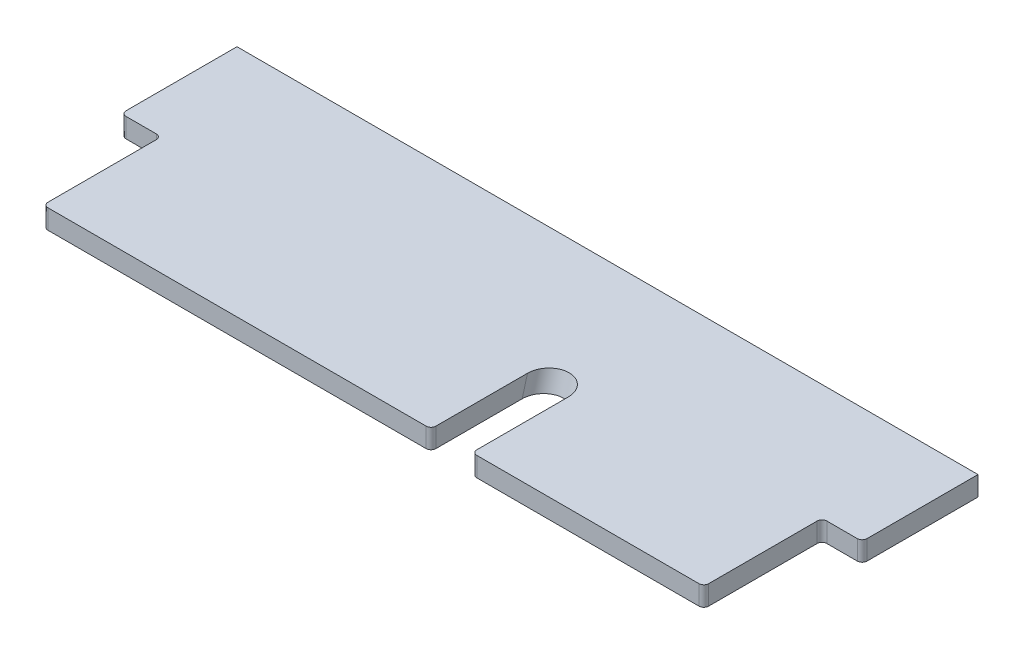
ISO-10303-21;
HEADER;
FILE_DESCRIPTION(('STEP AP214'),'2;1');
FILE_NAME('part.step','',(''),(''),'','','');
FILE_SCHEMA(('AUTOMOTIVE_DESIGN { 1 0 10303 214 1 1 1 1 }'));
ENDSEC;
DATA;
#1=APPLICATION_CONTEXT('core data for automotive mechanical design processes');
#2=APPLICATION_PROTOCOL_DEFINITION('international standard','automotive_design',2000,#1);
#3=PRODUCT_CONTEXT('',#1,'mechanical');
#4=PRODUCT('Part','Part','',(#3));
#5=PRODUCT_RELATED_PRODUCT_CATEGORY('part','',(#4));
#6=PRODUCT_DEFINITION_FORMATION('','',#4);
#7=PRODUCT_DEFINITION_CONTEXT('part definition',#1,'design');
#8=PRODUCT_DEFINITION('design','',#6,#7);
#9=PRODUCT_DEFINITION_SHAPE('','',#8);
#10=(LENGTH_UNIT() NAMED_UNIT(*) SI_UNIT(.MILLI.,.METRE.));
#11=(NAMED_UNIT(*) PLANE_ANGLE_UNIT() SI_UNIT($,.RADIAN.));
#12=(NAMED_UNIT(*) SI_UNIT($,.STERADIAN.) SOLID_ANGLE_UNIT());
#13=UNCERTAINTY_MEASURE_WITH_UNIT(LENGTH_MEASURE(1.E-05),#10,'distance_accuracy_value','');
#14=(GEOMETRIC_REPRESENTATION_CONTEXT(3) GLOBAL_UNCERTAINTY_ASSIGNED_CONTEXT((#13)) GLOBAL_UNIT_ASSIGNED_CONTEXT((#10,
#11,#12)) REPRESENTATION_CONTEXT('',''));
#15=CARTESIAN_POINT('',(0.,0.,0.));
#16=DIRECTION('',(0.,0.,1.));
#17=DIRECTION('',(1.,0.,0.));
#18=AXIS2_PLACEMENT_3D('',#15,#16,#17);
#19=CARTESIAN_POINT('',(-215.9,6.35,76.2));
#20=DIRECTION('',(0.,0.,-1.));
#21=DIRECTION('',(-1.,0.,0.));
#22=AXIS2_PLACEMENT_3D('',#19,#20,#21);
#23=PLANE('',#22);
#24=DIRECTION('',(1.,0.,0.));
#25=VECTOR('',#24,1.);
#26=CARTESIAN_POINT('',(-215.9,6.35,76.2));
#27=LINE('',#26,#25);
#28=CARTESIAN_POINT('',(-211.963,6.35,76.2));
#29=VERTEX_POINT('',#28);
#30=CARTESIAN_POINT('',(34.2899999999999,6.35,76.2));
#31=VERTEX_POINT('',#30);
#32=EDGE_CURVE('E230',#29,#31,#27,.T.);
#33=ORIENTED_EDGE('',*,*,#32,.F.);
#34=DIRECTION('',(0.,-1.,0.));
#35=VECTOR('',#34,1.);
#36=CARTESIAN_POINT('',(-211.963,6.35,76.2));
#37=LINE('',#36,#35);
#38=CARTESIAN_POINT('',(-211.963,-6.35,76.2));
#39=VERTEX_POINT('',#38);
#40=EDGE_CURVE('E352',#29,#39,#37,.T.);
#41=ORIENTED_EDGE('',*,*,#40,.T.);
#42=DIRECTION('',(1.,0.,0.));
#43=VECTOR('',#42,1.);
#44=CARTESIAN_POINT('',(-215.9,-6.35,76.2));
#45=LINE('',#44,#43);
#46=CARTESIAN_POINT('',(34.2899999999999,-6.35,76.2));
#47=VERTEX_POINT('',#46);
#48=EDGE_CURVE('E300',#39,#47,#45,.T.);
#49=ORIENTED_EDGE('',*,*,#48,.T.);
#50=DIRECTION('',(0.,-1.,0.));
#51=VECTOR('',#50,1.);
#52=CARTESIAN_POINT('',(34.2899999999999,6.35,76.2));
#53=LINE('',#52,#51);
#54=EDGE_CURVE('E64',#47,#31,#53,.F.);
#55=ORIENTED_EDGE('',*,*,#54,.T.);
#56=EDGE_LOOP('',(#33,#41,#49,#55));
#57=FACE_BOUND('',#56,.T.);
#58=ADVANCED_FACE('F48',(#57),#23,.F.);
#59=CARTESIAN_POINT('',(50.7999999999986,94.7896928963142,-10.6042856199856));
#60=DIRECTION('',(0.,-0.965182723476007,0.261576585923584));
#61=DIRECTION('',(0.,-0.261576585923584,-0.965182723476007));
#62=AXIS2_PLACEMENT_3D('',#59,#60,#61);
#63=CYLINDRICAL_SURFACE('',#62,13.3350000000001);
#64=CARTESIAN_POINT('',(50.7999999999986,6.34999999999999,13.363976933072));
#65=DIRECTION('',(0.,1.,0.));
#66=DIRECTION('',(0.,0.,1.));
#67=AXIS2_PLACEMENT_3D('',#64,#65,#66);
#68=ELLIPSE('',#67,13.8160367727838,13.3350000000001);
#69=CARTESIAN_POINT('',(37.4649999999999,6.34999999999999,13.363976933072));
#70=VERTEX_POINT('',#69);
#71=CARTESIAN_POINT('',(64.135,6.34999999999999,13.363976933072));
#72=VERTEX_POINT('',#71);
#73=EDGE_CURVE('E254',#70,#72,#68,.F.);
#74=ORIENTED_EDGE('',*,*,#73,.F.);
#75=DIRECTION('',(0.,-0.965182723476007,0.261576585923584));
#76=VECTOR('',#75,1.);
#77=CARTESIAN_POINT('',(37.4649999999985,94.7896928963142,-10.6042856199856));
#78=LINE('',#77,#76);
#79=CARTESIAN_POINT('',(37.4649999999999,-6.34999999999999,16.8058357235667));
#80=VERTEX_POINT('',#79);
#81=EDGE_CURVE('E277',#80,#70,#78,.F.);
#82=ORIENTED_EDGE('',*,*,#81,.F.);
#83=CARTESIAN_POINT('',(50.7999999999986,-6.34999999999999,16.8058357235667));
#84=DIRECTION('',(0.,1.,0.));
#85=DIRECTION('',(0.,0.,1.));
#86=AXIS2_PLACEMENT_3D('',#83,#84,#85);
#87=ELLIPSE('',#86,13.8160367727838,13.3350000000001);
#88=CARTESIAN_POINT('',(64.135,-6.34999999999999,16.8058357235667));
#89=VERTEX_POINT('',#88);
#90=EDGE_CURVE('E233',#80,#89,#87,.F.);
#91=ORIENTED_EDGE('',*,*,#90,.T.);
#92=DIRECTION('',(0.,-0.965182723476007,0.261576585923584));
#93=VECTOR('',#92,1.);
#94=CARTESIAN_POINT('',(64.1349999999987,94.7896928963142,-10.6042856199856));
#95=LINE('',#94,#93);
#96=EDGE_CURVE('E249',#89,#72,#95,.F.);
#97=ORIENTED_EDGE('',*,*,#96,.T.);
#98=EDGE_LOOP('',(#74,#82,#91,#97));
#99=FACE_BOUND('',#98,.T.);
#100=ADVANCED_FACE('F465',(#99),#63,.F.);
#101=CARTESIAN_POINT('',(215.138,6.35,0.));
#102=DIRECTION('',(-1.,0.,0.));
#103=DIRECTION('',(0.,0.,1.));
#104=AXIS2_PLACEMENT_3D('',#101,#102,#103);
#105=PLANE('',#104);
#106=DIRECTION('',(0.,0.,-1.));
#107=VECTOR('',#106,1.);
#108=CARTESIAN_POINT('',(215.138,6.35,0.));
#109=LINE('',#108,#107);
#110=CARTESIAN_POINT('',(215.138,6.35,73.025));
#111=VERTEX_POINT('',#110);
#112=CARTESIAN_POINT('',(215.138,6.35,2.41300000000001));
#113=VERTEX_POINT('',#112);
#114=EDGE_CURVE('E250',#111,#113,#109,.T.);
#115=ORIENTED_EDGE('',*,*,#114,.F.);
#116=DIRECTION('',(0.,-1.,0.));
#117=VECTOR('',#116,1.);
#118=CARTESIAN_POINT('',(215.138,6.35,73.025));
#119=LINE('',#118,#117);
#120=CARTESIAN_POINT('',(215.138,-6.35,73.025));
#121=VERTEX_POINT('',#120);
#122=EDGE_CURVE('E306',#111,#121,#119,.T.);
#123=ORIENTED_EDGE('',*,*,#122,.T.);
#124=DIRECTION('',(0.,0.,-1.));
#125=VECTOR('',#124,1.);
#126=CARTESIAN_POINT('',(215.138,-6.35,0.));
#127=LINE('',#126,#125);
#128=CARTESIAN_POINT('',(215.138,-6.35,2.41300000000001));
#129=VERTEX_POINT('',#128);
#130=EDGE_CURVE('E245',#121,#129,#127,.T.);
#131=ORIENTED_EDGE('',*,*,#130,.T.);
#132=DIRECTION('',(0.,-1.,0.));
#133=VECTOR('',#132,1.);
#134=CARTESIAN_POINT('',(215.138,6.35,2.41300000000001));
#135=LINE('',#134,#133);
#136=EDGE_CURVE('E289',#129,#113,#135,.F.);
#137=ORIENTED_EDGE('',*,*,#136,.T.);
#138=EDGE_LOOP('',(#115,#123,#131,#137));
#139=FACE_BOUND('',#138,.T.);
#140=ADVANCED_FACE('F404',(#139),#105,.F.);
#141=CARTESIAN_POINT('',(215.9,6.35,-0.761999999999986));
#142=DIRECTION('',(0.,0.,-1.));
#143=DIRECTION('',(-1.,0.,0.));
#144=AXIS2_PLACEMENT_3D('',#141,#142,#143);
#145=PLANE('',#144);
#146=DIRECTION('',(1.,0.,0.));
#147=VECTOR('',#146,1.);
#148=CARTESIAN_POINT('',(215.9,-6.35,-0.761999999999986));
#149=LINE('',#148,#147);
#150=CARTESIAN_POINT('',(218.313,-6.35,-0.761999999999986));
#151=VERTEX_POINT('',#150);
#152=CARTESIAN_POINT('',(238.125,-6.35,-0.761999999999986));
#153=VERTEX_POINT('',#152);
#154=EDGE_CURVE('E229',#151,#153,#149,.T.);
#155=ORIENTED_EDGE('',*,*,#154,.T.);
#156=DIRECTION('',(0.,-1.,0.));
#157=VECTOR('',#156,1.);
#158=CARTESIAN_POINT('',(238.125,6.35,-0.761999999999986));
#159=LINE('',#158,#157);
#160=CARTESIAN_POINT('',(238.125,6.35,-0.761999999999986));
#161=VERTEX_POINT('',#160);
#162=EDGE_CURVE('E381',#153,#161,#159,.F.);
#163=ORIENTED_EDGE('',*,*,#162,.T.);
#164=DIRECTION('',(1.,0.,0.));
#165=VECTOR('',#164,1.);
#166=CARTESIAN_POINT('',(215.9,6.35,-0.761999999999986));
#167=LINE('',#166,#165);
#168=CARTESIAN_POINT('',(218.313,6.35,-0.761999999999986));
#169=VERTEX_POINT('',#168);
#170=EDGE_CURVE('E244',#169,#161,#167,.T.);
#171=ORIENTED_EDGE('',*,*,#170,.F.);
#172=DIRECTION('',(0.,-1.,0.));
#173=VECTOR('',#172,1.);
#174=CARTESIAN_POINT('',(218.313,-6.35,-0.761999999999986));
#175=LINE('',#174,#173);
#176=EDGE_CURVE('E377',#169,#151,#175,.T.);
#177=ORIENTED_EDGE('',*,*,#176,.T.);
#178=EDGE_LOOP('',(#155,#163,#171,#177));
#179=FACE_BOUND('',#178,.T.);
#180=ADVANCED_FACE('F413',(#179),#145,.F.);
#181=CARTESIAN_POINT('',(241.3,6.35,-76.2));
#182=DIRECTION('',(-1.,0.,0.));
#183=DIRECTION('',(0.,0.,1.));
#184=AXIS2_PLACEMENT_3D('',#181,#182,#183);
#185=PLANE('',#184);
#186=DIRECTION('',(0.,0.,-1.));
#187=VECTOR('',#186,1.);
#188=CARTESIAN_POINT('',(241.3,6.35,-76.2));
#189=LINE('',#188,#187);
#190=CARTESIAN_POINT('',(241.3,6.35,-3.93700000000001));
#191=VERTEX_POINT('',#190);
#192=CARTESIAN_POINT('',(241.3,6.35,-76.2));
#193=VERTEX_POINT('',#192);
#194=EDGE_CURVE('E241',#191,#193,#189,.T.);
#195=ORIENTED_EDGE('',*,*,#194,.F.);
#196=DIRECTION('',(0.,-1.,0.));
#197=VECTOR('',#196,1.);
#198=CARTESIAN_POINT('',(241.3,6.35,-3.93699999999998));
#199=LINE('',#198,#197);
#200=CARTESIAN_POINT('',(241.3,-6.35,-3.93700000000001));
#201=VERTEX_POINT('',#200);
#202=EDGE_CURVE('E373',#191,#201,#199,.T.);
#203=ORIENTED_EDGE('',*,*,#202,.T.);
#204=DIRECTION('',(0.,0.,-1.));
#205=VECTOR('',#204,1.);
#206=CARTESIAN_POINT('',(241.3,-6.35,-76.2));
#207=LINE('',#206,#205);
#208=CARTESIAN_POINT('',(241.3,-6.35,-76.2));
#209=VERTEX_POINT('',#208);
#210=EDGE_CURVE('E204',#201,#209,#207,.T.);
#211=ORIENTED_EDGE('',*,*,#210,.T.);
#212=DIRECTION('',(0.,-1.,0.));
#213=VECTOR('',#212,1.);
#214=CARTESIAN_POINT('',(241.3,6.35,-76.2));
#215=LINE('',#214,#213);
#216=EDGE_CURVE('E199',#193,#209,#215,.T.);
#217=ORIENTED_EDGE('',*,*,#216,.F.);
#218=EDGE_LOOP('',(#195,#203,#211,#217));
#219=FACE_BOUND('',#218,.T.);
#220=ADVANCED_FACE('F420',(#219),#185,.F.);
#221=CARTESIAN_POINT('',(-215.9,6.35,-76.2));
#222=DIRECTION('',(0.,0.,1.));
#223=DIRECTION('',(1.,0.,0.));
#224=AXIS2_PLACEMENT_3D('',#221,#222,#223);
#225=PLANE('',#224);
#226=DIRECTION('',(-1.,0.,0.));
#227=VECTOR('',#226,1.);
#228=CARTESIAN_POINT('',(-215.9,-6.35,-76.2));
#229=LINE('',#228,#227);
#230=CARTESIAN_POINT('',(-241.3,-6.35,-76.2));
#231=VERTEX_POINT('',#230);
#232=EDGE_CURVE('E192',#209,#231,#229,.T.);
#233=ORIENTED_EDGE('',*,*,#232,.T.);
#234=DIRECTION('',(0.,-1.,0.));
#235=VECTOR('',#234,1.);
#236=CARTESIAN_POINT('',(-241.3,6.35,-76.2));
#237=LINE('',#236,#235);
#238=CARTESIAN_POINT('',(-241.3,6.35,-76.2));
#239=VERTEX_POINT('',#238);
#240=EDGE_CURVE('E196',#239,#231,#237,.T.);
#241=ORIENTED_EDGE('',*,*,#240,.F.);
#242=DIRECTION('',(-1.,0.,0.));
#243=VECTOR('',#242,1.);
#244=CARTESIAN_POINT('',(215.9,6.35,-76.2));
#245=LINE('',#244,#243);
#246=EDGE_CURVE('E238',#193,#239,#245,.T.);
#247=ORIENTED_EDGE('',*,*,#246,.F.);
#248=ORIENTED_EDGE('',*,*,#216,.T.);
#249=EDGE_LOOP('',(#233,#241,#247,#248));
#250=FACE_BOUND('',#249,.T.);
#251=ADVANCED_FACE('F194',(#250),#225,.F.);
#252=CARTESIAN_POINT('',(-241.3,6.35,-76.2));
#253=DIRECTION('',(1.,0.,0.));
#254=DIRECTION('',(0.,0.,-1.));
#255=AXIS2_PLACEMENT_3D('',#252,#253,#254);
#256=PLANE('',#255);
#257=DIRECTION('',(0.,0.,1.));
#258=VECTOR('',#257,1.);
#259=CARTESIAN_POINT('',(-241.3,-6.35,-76.2));
#260=LINE('',#259,#258);
#261=CARTESIAN_POINT('',(-241.3,-6.35,-3.93700000000001));
#262=VERTEX_POINT('',#261);
#263=EDGE_CURVE('E209',#231,#262,#260,.T.);
#264=ORIENTED_EDGE('',*,*,#263,.T.);
#265=DIRECTION('',(0.,-1.,0.));
#266=VECTOR('',#265,1.);
#267=CARTESIAN_POINT('',(-241.3,6.35,-3.93699999999998));
#268=LINE('',#267,#266);
#269=CARTESIAN_POINT('',(-241.3,6.35,-3.93700000000001));
#270=VERTEX_POINT('',#269);
#271=EDGE_CURVE('E370',#262,#270,#268,.F.);
#272=ORIENTED_EDGE('',*,*,#271,.T.);
#273=DIRECTION('',(0.,0.,1.));
#274=VECTOR('',#273,1.);
#275=CARTESIAN_POINT('',(-241.3,6.35,-76.2));
#276=LINE('',#275,#274);
#277=EDGE_CURVE('E212',#239,#270,#276,.T.);
#278=ORIENTED_EDGE('',*,*,#277,.F.);
#279=ORIENTED_EDGE('',*,*,#240,.T.);
#280=EDGE_LOOP('',(#264,#272,#278,#279));
#281=FACE_BOUND('',#280,.T.);
#282=ADVANCED_FACE('F208',(#281),#256,.F.);
#283=CARTESIAN_POINT('',(-215.9,6.35,-0.76199999999999));
#284=DIRECTION('',(0.,0.,-1.));
#285=DIRECTION('',(-1.,0.,0.));
#286=AXIS2_PLACEMENT_3D('',#283,#284,#285);
#287=PLANE('',#286);
#288=DIRECTION('',(1.,0.,0.));
#289=VECTOR('',#288,1.);
#290=CARTESIAN_POINT('',(-215.9,-6.35,-0.76199999999999));
#291=LINE('',#290,#289);
#292=CARTESIAN_POINT('',(-238.125,-6.35,-0.761999999999987));
#293=VERTEX_POINT('',#292);
#294=CARTESIAN_POINT('',(-218.313,-6.35,-0.761999999999989));
#295=VERTEX_POINT('',#294);
#296=EDGE_CURVE('E214',#293,#295,#291,.T.);
#297=ORIENTED_EDGE('',*,*,#296,.T.);
#298=DIRECTION('',(0.,-1.,0.));
#299=VECTOR('',#298,1.);
#300=CARTESIAN_POINT('',(-218.313,6.35,-0.761999999999989));
#301=LINE('',#300,#299);
#302=CARTESIAN_POINT('',(-218.313,6.35,-0.761999999999989));
#303=VERTEX_POINT('',#302);
#304=EDGE_CURVE('E367',#295,#303,#301,.F.);
#305=ORIENTED_EDGE('',*,*,#304,.T.);
#306=DIRECTION('',(1.,0.,0.));
#307=VECTOR('',#306,1.);
#308=CARTESIAN_POINT('',(-215.9,6.35,-0.76199999999999));
#309=LINE('',#308,#307);
#310=CARTESIAN_POINT('',(-238.125,6.35,-0.761999999999987));
#311=VERTEX_POINT('',#310);
#312=EDGE_CURVE('E237',#311,#303,#309,.T.);
#313=ORIENTED_EDGE('',*,*,#312,.F.);
#314=DIRECTION('',(0.,-1.,0.));
#315=VECTOR('',#314,1.);
#316=CARTESIAN_POINT('',(-238.125,6.35,-0.761999999999987));
#317=LINE('',#316,#315);
#318=EDGE_CURVE('E363',#311,#293,#317,.T.);
#319=ORIENTED_EDGE('',*,*,#318,.T.);
#320=EDGE_LOOP('',(#297,#305,#313,#319));
#321=FACE_BOUND('',#320,.T.);
#322=ADVANCED_FACE('F427',(#321),#287,.F.);
#323=CARTESIAN_POINT('',(-215.138,6.35,0.));
#324=DIRECTION('',(1.,0.,0.));
#325=DIRECTION('',(0.,0.,-1.));
#326=AXIS2_PLACEMENT_3D('',#323,#324,#325);
#327=PLANE('',#326);
#328=DIRECTION('',(0.,0.,1.));
#329=VECTOR('',#328,1.);
#330=CARTESIAN_POINT('',(-215.138,-6.35,0.));
#331=LINE('',#330,#329);
#332=CARTESIAN_POINT('',(-215.138,-6.35,2.41300000000001));
#333=VERTEX_POINT('',#332);
#334=CARTESIAN_POINT('',(-215.138,-6.35,73.025));
#335=VERTEX_POINT('',#334);
#336=EDGE_CURVE('E261',#333,#335,#331,.T.);
#337=ORIENTED_EDGE('',*,*,#336,.T.);
#338=DIRECTION('',(0.,-1.,0.));
#339=VECTOR('',#338,1.);
#340=CARTESIAN_POINT('',(-215.138,6.35,73.025));
#341=LINE('',#340,#339);
#342=CARTESIAN_POINT('',(-215.138,6.35,73.025));
#343=VERTEX_POINT('',#342);
#344=EDGE_CURVE('E360',#335,#343,#341,.F.);
#345=ORIENTED_EDGE('',*,*,#344,.T.);
#346=DIRECTION('',(0.,0.,1.));
#347=VECTOR('',#346,1.);
#348=CARTESIAN_POINT('',(-215.138,6.35,0.));
#349=LINE('',#348,#347);
#350=CARTESIAN_POINT('',(-215.138,6.35,2.41300000000001));
#351=VERTEX_POINT('',#350);
#352=EDGE_CURVE('E271',#351,#343,#349,.T.);
#353=ORIENTED_EDGE('',*,*,#352,.F.);
#354=DIRECTION('',(0.,-1.,0.));
#355=VECTOR('',#354,1.);
#356=CARTESIAN_POINT('',(-215.138,-6.35,2.41300000000001));
#357=LINE('',#356,#355);
#358=EDGE_CURVE('E356',#351,#333,#357,.T.);
#359=ORIENTED_EDGE('',*,*,#358,.T.);
#360=EDGE_LOOP('',(#337,#345,#353,#359));
#361=FACE_BOUND('',#360,.T.);
#362=ADVANCED_FACE('F436',(#361),#327,.F.);
#363=CARTESIAN_POINT('',(67.31,-6.35,76.2));
#364=VERTEX_POINT('',#363);
#365=CARTESIAN_POINT('',(211.963,-6.35,76.2));
#366=VERTEX_POINT('',#365);
#367=EDGE_CURVE('E225',#364,#366,#45,.T.);
#368=ORIENTED_EDGE('',*,*,#367,.T.);
#369=DIRECTION('',(0.,-1.,0.));
#370=VECTOR('',#369,1.);
#371=CARTESIAN_POINT('',(211.963,6.35,76.2));
#372=LINE('',#371,#370);
#373=CARTESIAN_POINT('',(211.963,6.35,76.2));
#374=VERTEX_POINT('',#373);
#375=EDGE_CURVE('E330',#366,#374,#372,.F.);
#376=ORIENTED_EDGE('',*,*,#375,.T.);
#377=CARTESIAN_POINT('',(67.31,6.35,76.2));
#378=VERTEX_POINT('',#377);
#379=EDGE_CURVE('E234',#378,#374,#27,.T.);
#380=ORIENTED_EDGE('',*,*,#379,.F.);
#381=DIRECTION('',(0.,1.,0.));
#382=VECTOR('',#381,1.);
#383=CARTESIAN_POINT('',(67.31,6.35,76.2));
#384=LINE('',#383,#382);
#385=EDGE_CURVE('E327',#378,#364,#384,.F.);
#386=ORIENTED_EDGE('',*,*,#385,.T.);
#387=EDGE_LOOP('',(#368,#376,#380,#386));
#388=FACE_BOUND('',#387,.T.);
#389=ADVANCED_FACE('F448',(#388),#23,.F.);
#390=CARTESIAN_POINT('',(0.,6.35,0.));
#391=DIRECTION('',(0.,1.,0.));
#392=DIRECTION('',(0.,0.,1.));
#393=AXIS2_PLACEMENT_3D('',#390,#391,#392);
#394=PLANE('',#393);
#395=ORIENTED_EDGE('',*,*,#379,.T.);
#396=CARTESIAN_POINT('',(211.963,6.35,73.025));
#397=DIRECTION('',(0.,1.,0.));
#398=DIRECTION('',(0.,0.,1.));
#399=AXIS2_PLACEMENT_3D('',#396,#397,#398);
#400=CIRCLE('',#399,3.175);
#401=EDGE_CURVE('E347',#374,#111,#400,.T.);
#402=ORIENTED_EDGE('',*,*,#401,.T.);
#403=ORIENTED_EDGE('',*,*,#114,.T.);
#404=CARTESIAN_POINT('',(218.313,6.35,2.41300000000001));
#405=DIRECTION('',(0.,1.,0.));
#406=DIRECTION('',(0.,0.,1.));
#407=AXIS2_PLACEMENT_3D('',#404,#405,#406);
#408=CIRCLE('',#407,3.175);
#409=EDGE_CURVE('E12',#113,#169,#408,.F.);
#410=ORIENTED_EDGE('',*,*,#409,.T.);
#411=ORIENTED_EDGE('',*,*,#170,.T.);
#412=CARTESIAN_POINT('',(238.125,6.35,-3.93699999999998));
#413=DIRECTION('',(0.,1.,0.));
#414=DIRECTION('',(0.,0.,1.));
#415=AXIS2_PLACEMENT_3D('',#412,#413,#414);
#416=CIRCLE('',#415,3.175);
#417=EDGE_CURVE('E339',#161,#191,#416,.T.);
#418=ORIENTED_EDGE('',*,*,#417,.T.);
#419=ORIENTED_EDGE('',*,*,#194,.T.);
#420=ORIENTED_EDGE('',*,*,#246,.T.);
#421=ORIENTED_EDGE('',*,*,#277,.T.);
#422=CARTESIAN_POINT('',(-238.125,6.35,-3.93699999999999));
#423=DIRECTION('',(0.,1.,0.));
#424=DIRECTION('',(0.,0.,1.));
#425=AXIS2_PLACEMENT_3D('',#422,#423,#424);
#426=CIRCLE('',#425,3.175);
#427=EDGE_CURVE('E342',#270,#311,#426,.T.);
#428=ORIENTED_EDGE('',*,*,#427,.T.);
#429=ORIENTED_EDGE('',*,*,#312,.T.);
#430=CARTESIAN_POINT('',(-218.313,6.35,2.41300000000001));
#431=DIRECTION('',(0.,1.,0.));
#432=DIRECTION('',(0.,0.,1.));
#433=AXIS2_PLACEMENT_3D('',#430,#431,#432);
#434=CIRCLE('',#433,3.175);
#435=EDGE_CURVE('E395',#303,#351,#434,.F.);
#436=ORIENTED_EDGE('',*,*,#435,.T.);
#437=ORIENTED_EDGE('',*,*,#352,.T.);
#438=CARTESIAN_POINT('',(-211.963,6.35,73.025));
#439=DIRECTION('',(0.,1.,0.));
#440=DIRECTION('',(0.,0.,1.));
#441=AXIS2_PLACEMENT_3D('',#438,#439,#440);
#442=CIRCLE('',#441,3.175);
#443=EDGE_CURVE('E71',#343,#29,#442,.T.);
#444=ORIENTED_EDGE('',*,*,#443,.T.);
#445=ORIENTED_EDGE('',*,*,#32,.T.);
#446=CARTESIAN_POINT('',(34.2899999999999,6.35,73.025));
#447=DIRECTION('',(0.,1.,0.));
#448=DIRECTION('',(0.,0.,1.));
#449=AXIS2_PLACEMENT_3D('',#446,#447,#448);
#450=CIRCLE('',#449,3.175);
#451=CARTESIAN_POINT('',(37.4649999999999,6.35,73.025));
#452=VERTEX_POINT('',#451);
#453=EDGE_CURVE('E333',#31,#452,#450,.T.);
#454=ORIENTED_EDGE('',*,*,#453,.T.);
#455=DIRECTION('',(0.,0.,1.));
#456=VECTOR('',#455,1.);
#457=CARTESIAN_POINT('',(37.4649999999999,6.35,0.));
#458=LINE('',#457,#456);
#459=EDGE_CURVE('E293',#70,#452,#458,.T.);
#460=ORIENTED_EDGE('',*,*,#459,.F.);
#461=ORIENTED_EDGE('',*,*,#73,.T.);
#462=DIRECTION('',(0.,0.,1.));
#463=VECTOR('',#462,1.);
#464=CARTESIAN_POINT('',(64.135,6.35,-76.201));
#465=LINE('',#464,#463);
#466=CARTESIAN_POINT('',(64.135,6.35,73.025));
#467=VERTEX_POINT('',#466);
#468=EDGE_CURVE('E280',#72,#467,#465,.T.);
#469=ORIENTED_EDGE('',*,*,#468,.T.);
#470=CARTESIAN_POINT('',(67.31,6.35,73.025));
#471=DIRECTION('',(0.,1.,0.));
#472=DIRECTION('',(0.,0.,1.));
#473=AXIS2_PLACEMENT_3D('',#470,#471,#472);
#474=CIRCLE('',#473,3.175);
#475=EDGE_CURVE('E336',#467,#378,#474,.T.);
#476=ORIENTED_EDGE('',*,*,#475,.T.);
#477=EDGE_LOOP('',(#395,#402,#403,#410,#411,#418,#419,#420,#421,#428,#429,#436,#437,#444,#445,
#454,#460,#461,#469,#476));
#478=FACE_BOUND('',#477,.T.);
#479=ADVANCED_FACE('F410',(#478),#394,.T.);
#480=CARTESIAN_POINT('',(0.,-6.35,0.));
#481=DIRECTION('',(0.,1.,0.));
#482=DIRECTION('',(0.,0.,1.));
#483=AXIS2_PLACEMENT_3D('',#480,#481,#482);
#484=PLANE('',#483);
#485=ORIENTED_EDGE('',*,*,#130,.F.);
#486=CARTESIAN_POINT('',(211.963,-6.35,73.025));
#487=DIRECTION('',(0.,1.,0.));
#488=DIRECTION('',(0.,0.,1.));
#489=AXIS2_PLACEMENT_3D('',#486,#487,#488);
#490=CIRCLE('',#489,3.175);
#491=EDGE_CURVE('E324',#121,#366,#490,.F.);
#492=ORIENTED_EDGE('',*,*,#491,.T.);
#493=ORIENTED_EDGE('',*,*,#367,.F.);
#494=CARTESIAN_POINT('',(67.31,-6.35,73.025));
#495=DIRECTION('',(0.,1.,0.));
#496=DIRECTION('',(0.,0.,1.));
#497=AXIS2_PLACEMENT_3D('',#494,#495,#496);
#498=CIRCLE('',#497,3.175);
#499=CARTESIAN_POINT('',(64.135,-6.35,73.025));
#500=VERTEX_POINT('',#499);
#501=EDGE_CURVE('E313',#364,#500,#498,.F.);
#502=ORIENTED_EDGE('',*,*,#501,.T.);
#503=DIRECTION('',(0.,0.,1.));
#504=VECTOR('',#503,1.);
#505=CARTESIAN_POINT('',(64.135,-6.35,-76.201));
#506=LINE('',#505,#504);
#507=EDGE_CURVE('E281',#89,#500,#506,.T.);
#508=ORIENTED_EDGE('',*,*,#507,.F.);
#509=ORIENTED_EDGE('',*,*,#90,.F.);
#510=DIRECTION('',(0.,0.,1.));
#511=VECTOR('',#510,1.);
#512=CARTESIAN_POINT('',(37.4649999999999,-6.35,0.));
#513=LINE('',#512,#511);
#514=CARTESIAN_POINT('',(37.4649999999999,-6.35,73.025));
#515=VERTEX_POINT('',#514);
#516=EDGE_CURVE('E285',#80,#515,#513,.T.);
#517=ORIENTED_EDGE('',*,*,#516,.T.);
#518=CARTESIAN_POINT('',(34.2899999999999,-6.35,73.025));
#519=DIRECTION('',(0.,1.,0.));
#520=DIRECTION('',(0.,0.,1.));
#521=AXIS2_PLACEMENT_3D('',#518,#519,#520);
#522=CIRCLE('',#521,3.175);
#523=EDGE_CURVE('E310',#515,#47,#522,.F.);
#524=ORIENTED_EDGE('',*,*,#523,.T.);
#525=ORIENTED_EDGE('',*,*,#48,.F.);
#526=CARTESIAN_POINT('',(-211.963,-6.35,73.025));
#527=DIRECTION('',(0.,1.,0.));
#528=DIRECTION('',(0.,0.,1.));
#529=AXIS2_PLACEMENT_3D('',#526,#527,#528);
#530=CIRCLE('',#529,3.175);
#531=EDGE_CURVE('E321',#39,#335,#530,.F.);
#532=ORIENTED_EDGE('',*,*,#531,.T.);
#533=ORIENTED_EDGE('',*,*,#336,.F.);
#534=CARTESIAN_POINT('',(-218.313,-6.35,2.41300000000001));
#535=DIRECTION('',(0.,1.,0.));
#536=DIRECTION('',(0.,0.,1.));
#537=AXIS2_PLACEMENT_3D('',#534,#535,#536);
#538=CIRCLE('',#537,3.175);
#539=EDGE_CURVE('E392',#333,#295,#538,.T.);
#540=ORIENTED_EDGE('',*,*,#539,.T.);
#541=ORIENTED_EDGE('',*,*,#296,.F.);
#542=CARTESIAN_POINT('',(-238.125,-6.35,-3.93699999999999));
#543=DIRECTION('',(0.,1.,0.));
#544=DIRECTION('',(0.,0.,1.));
#545=AXIS2_PLACEMENT_3D('',#542,#543,#544);
#546=CIRCLE('',#545,3.175);
#547=EDGE_CURVE('E219',#293,#262,#546,.F.);
#548=ORIENTED_EDGE('',*,*,#547,.T.);
#549=ORIENTED_EDGE('',*,*,#263,.F.);
#550=ORIENTED_EDGE('',*,*,#232,.F.);
#551=ORIENTED_EDGE('',*,*,#210,.F.);
#552=CARTESIAN_POINT('',(238.125,-6.35,-3.93699999999998));
#553=DIRECTION('',(0.,1.,0.));
#554=DIRECTION('',(0.,0.,1.));
#555=AXIS2_PLACEMENT_3D('',#552,#553,#554);
#556=CIRCLE('',#555,3.175);
#557=EDGE_CURVE('E316',#201,#153,#556,.F.);
#558=ORIENTED_EDGE('',*,*,#557,.T.);
#559=ORIENTED_EDGE('',*,*,#154,.F.);
#560=CARTESIAN_POINT('',(218.313,-6.35,2.41300000000001));
#561=DIRECTION('',(0.,1.,0.));
#562=DIRECTION('',(0.,0.,1.));
#563=AXIS2_PLACEMENT_3D('',#560,#561,#562);
#564=CIRCLE('',#563,3.175);
#565=EDGE_CURVE('E57',#151,#129,#564,.T.);
#566=ORIENTED_EDGE('',*,*,#565,.T.);
#567=EDGE_LOOP('',(#485,#492,#493,#502,#508,#509,#517,#524,#525,#532,#533,#540,#541,#548,#549,
#550,#551,#558,#559,#566));
#568=FACE_BOUND('',#567,.T.);
#569=ADVANCED_FACE('F217',(#568),#484,.F.);
#570=CARTESIAN_POINT('',(64.135,6.34999999999999,-76.201));
#571=DIRECTION('',(1.,0.,0.));
#572=DIRECTION('',(0.,0.,-1.));
#573=AXIS2_PLACEMENT_3D('',#570,#571,#572);
#574=PLANE('',#573);
#575=ORIENTED_EDGE('',*,*,#507,.T.);
#576=DIRECTION('',(0.,1.,0.));
#577=VECTOR('',#576,1.);
#578=CARTESIAN_POINT('',(64.135,6.34999999999999,73.025));
#579=LINE('',#578,#577);
#580=EDGE_CURVE('E384',#500,#467,#579,.T.);
#581=ORIENTED_EDGE('',*,*,#580,.T.);
#582=ORIENTED_EDGE('',*,*,#468,.F.);
#583=ORIENTED_EDGE('',*,*,#96,.F.);
#584=EDGE_LOOP('',(#575,#581,#582,#583));
#585=FACE_BOUND('',#584,.T.);
#586=ADVANCED_FACE('F462',(#585),#574,.F.);
#587=CARTESIAN_POINT('',(37.4649999999999,6.34999999999999,-76.201));
#588=DIRECTION('',(-1.,0.,0.));
#589=DIRECTION('',(0.,0.,1.));
#590=AXIS2_PLACEMENT_3D('',#587,#588,#589);
#591=PLANE('',#590);
#592=ORIENTED_EDGE('',*,*,#459,.T.);
#593=DIRECTION('',(0.,-1.,0.));
#594=VECTOR('',#593,1.);
#595=CARTESIAN_POINT('',(37.4649999999999,6.34999999999999,73.025));
#596=LINE('',#595,#594);
#597=EDGE_CURVE('E388',#452,#515,#596,.T.);
#598=ORIENTED_EDGE('',*,*,#597,.T.);
#599=ORIENTED_EDGE('',*,*,#516,.F.);
#600=ORIENTED_EDGE('',*,*,#81,.T.);
#601=EDGE_LOOP('',(#592,#598,#599,#600));
#602=FACE_BOUND('',#601,.T.);
#603=ADVANCED_FACE('F471',(#602),#591,.F.);
#604=CARTESIAN_POINT('',(211.963,6.35,73.025));
#605=DIRECTION('',(0.,-1.,0.));
#606=DIRECTION('',(0.,0.,-1.));
#607=AXIS2_PLACEMENT_3D('',#604,#605,#606);
#608=CYLINDRICAL_SURFACE('',#607,3.175);
#609=ORIENTED_EDGE('',*,*,#401,.F.);
#610=ORIENTED_EDGE('',*,*,#375,.F.);
#611=ORIENTED_EDGE('',*,*,#491,.F.);
#612=ORIENTED_EDGE('',*,*,#122,.F.);
#613=EDGE_LOOP('',(#609,#610,#611,#612));
#614=FACE_BOUND('',#613,.T.);
#615=ADVANCED_FACE('F454',(#614),#608,.T.);
#616=CARTESIAN_POINT('',(-211.963,6.35,73.025));
#617=DIRECTION('',(0.,-1.,0.));
#618=DIRECTION('',(0.,0.,-1.));
#619=AXIS2_PLACEMENT_3D('',#616,#617,#618);
#620=CYLINDRICAL_SURFACE('',#619,3.175);
#621=ORIENTED_EDGE('',*,*,#443,.F.);
#622=ORIENTED_EDGE('',*,*,#344,.F.);
#623=ORIENTED_EDGE('',*,*,#531,.F.);
#624=ORIENTED_EDGE('',*,*,#40,.F.);
#625=EDGE_LOOP('',(#621,#622,#623,#624));
#626=FACE_BOUND('',#625,.T.);
#627=ADVANCED_FACE('F440',(#626),#620,.T.);
#628=CARTESIAN_POINT('',(-218.313,6.35,2.41300000000001));
#629=DIRECTION('',(0.,1.,0.));
#630=DIRECTION('',(0.,0.,1.));
#631=AXIS2_PLACEMENT_3D('',#628,#629,#630);
#632=CYLINDRICAL_SURFACE('',#631,3.175);
#633=ORIENTED_EDGE('',*,*,#435,.F.);
#634=ORIENTED_EDGE('',*,*,#304,.F.);
#635=ORIENTED_EDGE('',*,*,#539,.F.);
#636=ORIENTED_EDGE('',*,*,#358,.F.);
#637=EDGE_LOOP('',(#633,#634,#635,#636));
#638=FACE_BOUND('',#637,.T.);
#639=ADVANCED_FACE('F433',(#638),#632,.F.);
#640=CARTESIAN_POINT('',(-238.125,6.35,-3.93699999999999));
#641=DIRECTION('',(0.,-1.,0.));
#642=DIRECTION('',(0.,0.,-1.));
#643=AXIS2_PLACEMENT_3D('',#640,#641,#642);
#644=CYLINDRICAL_SURFACE('',#643,3.175);
#645=ORIENTED_EDGE('',*,*,#427,.F.);
#646=ORIENTED_EDGE('',*,*,#271,.F.);
#647=ORIENTED_EDGE('',*,*,#547,.F.);
#648=ORIENTED_EDGE('',*,*,#318,.F.);
#649=EDGE_LOOP('',(#645,#646,#647,#648));
#650=FACE_BOUND('',#649,.T.);
#651=ADVANCED_FACE('F425',(#650),#644,.T.);
#652=CARTESIAN_POINT('',(238.125,6.35,-3.93699999999998));
#653=DIRECTION('',(0.,-1.,0.));
#654=DIRECTION('',(0.,0.,-1.));
#655=AXIS2_PLACEMENT_3D('',#652,#653,#654);
#656=CYLINDRICAL_SURFACE('',#655,3.175);
#657=ORIENTED_EDGE('',*,*,#417,.F.);
#658=ORIENTED_EDGE('',*,*,#162,.F.);
#659=ORIENTED_EDGE('',*,*,#557,.F.);
#660=ORIENTED_EDGE('',*,*,#202,.F.);
#661=EDGE_LOOP('',(#657,#658,#659,#660));
#662=FACE_BOUND('',#661,.T.);
#663=ADVANCED_FACE('F416',(#662),#656,.T.);
#664=CARTESIAN_POINT('',(218.313,6.35,2.41300000000001));
#665=DIRECTION('',(0.,1.,0.));
#666=DIRECTION('',(0.,0.,1.));
#667=AXIS2_PLACEMENT_3D('',#664,#665,#666);
#668=CYLINDRICAL_SURFACE('',#667,3.175);
#669=ORIENTED_EDGE('',*,*,#409,.F.);
#670=ORIENTED_EDGE('',*,*,#136,.F.);
#671=ORIENTED_EDGE('',*,*,#565,.F.);
#672=ORIENTED_EDGE('',*,*,#176,.F.);
#673=EDGE_LOOP('',(#669,#670,#671,#672));
#674=FACE_BOUND('',#673,.T.);
#675=ADVANCED_FACE('F407',(#674),#668,.F.);
#676=CARTESIAN_POINT('',(67.31,6.34999999999999,73.025));
#677=DIRECTION('',(0.,1.,0.));
#678=DIRECTION('',(0.,0.,1.));
#679=AXIS2_PLACEMENT_3D('',#676,#677,#678);
#680=CYLINDRICAL_SURFACE('',#679,3.175);
#681=ORIENTED_EDGE('',*,*,#501,.F.);
#682=ORIENTED_EDGE('',*,*,#385,.F.);
#683=ORIENTED_EDGE('',*,*,#475,.F.);
#684=ORIENTED_EDGE('',*,*,#580,.F.);
#685=EDGE_LOOP('',(#681,#682,#683,#684));
#686=FACE_BOUND('',#685,.T.);
#687=ADVANCED_FACE('F457',(#686),#680,.T.);
#688=CARTESIAN_POINT('',(34.2899999999999,6.34999999999999,73.025));
#689=DIRECTION('',(0.,-1.,0.));
#690=DIRECTION('',(0.,0.,-1.));
#691=AXIS2_PLACEMENT_3D('',#688,#689,#690);
#692=CYLINDRICAL_SURFACE('',#691,3.175);
#693=ORIENTED_EDGE('',*,*,#453,.F.);
#694=ORIENTED_EDGE('',*,*,#54,.F.);
#695=ORIENTED_EDGE('',*,*,#523,.F.);
#696=ORIENTED_EDGE('',*,*,#597,.F.);
#697=EDGE_LOOP('',(#693,#694,#695,#696));
#698=FACE_BOUND('',#697,.T.);
#699=ADVANCED_FACE('F50',(#698),#692,.T.);
#700=CLOSED_SHELL('',(#58,#100,#140,#180,#220,#251,#282,#322,#362,#389,#479,#569,#586,#603,#615,
#627,#639,#651,#663,#675,#687,#699));
#701=MANIFOLD_SOLID_BREP('B2',#700);
#702=ADVANCED_BREP_SHAPE_REPRESENTATION('',(#18,#701),#14);
#703=SHAPE_DEFINITION_REPRESENTATION(#9,#702);
ENDSEC;
END-ISO-10303-21;
